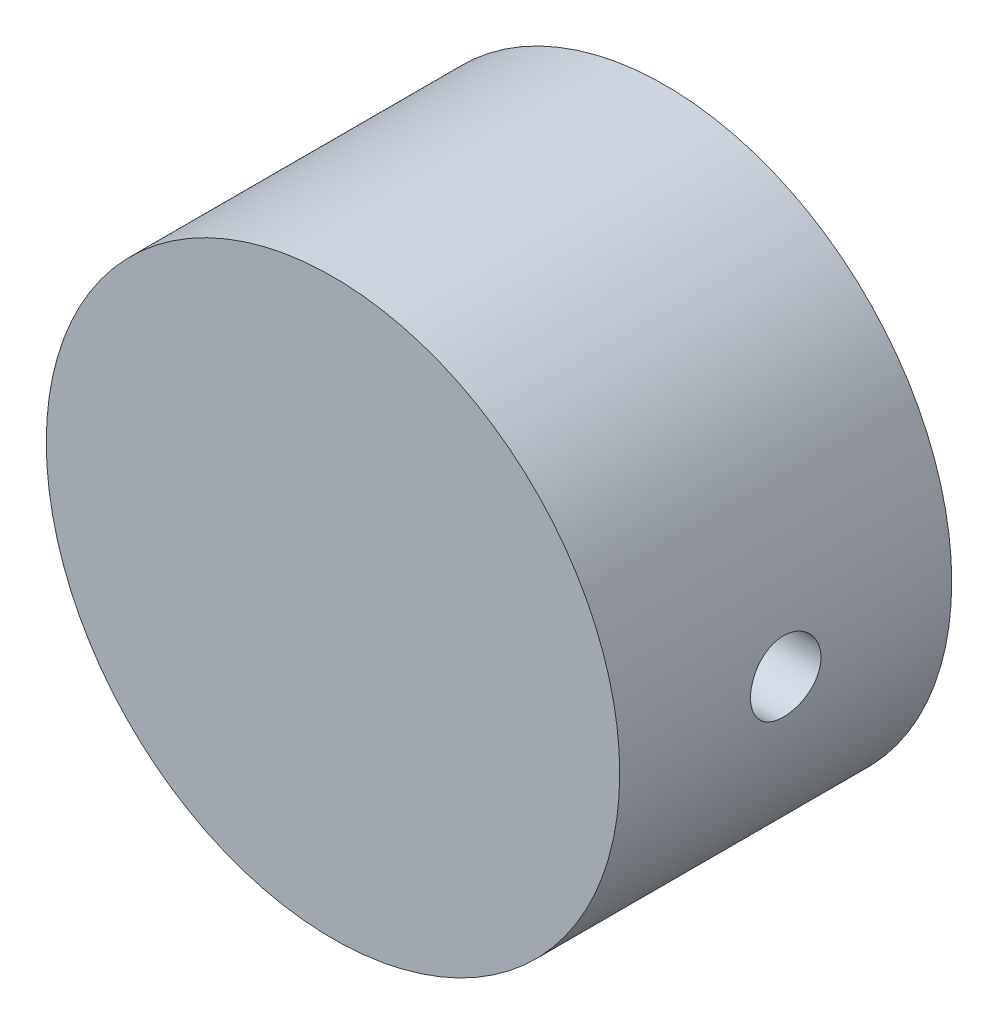
ISO-10303-21;
HEADER;
FILE_DESCRIPTION(('STEP AP214'),'2;1');
FILE_NAME('part.step','',(''),(''),'','','');
FILE_SCHEMA(('AUTOMOTIVE_DESIGN { 1 0 10303 214 1 1 1 1 }'));
ENDSEC;
DATA;
#1=APPLICATION_CONTEXT('core data for automotive mechanical design processes');
#2=APPLICATION_PROTOCOL_DEFINITION('international standard','automotive_design',2000,#1);
#3=PRODUCT_CONTEXT('',#1,'mechanical');
#4=PRODUCT('Part','Part','',(#3));
#5=PRODUCT_RELATED_PRODUCT_CATEGORY('part','',(#4));
#6=PRODUCT_DEFINITION_FORMATION('','',#4);
#7=PRODUCT_DEFINITION_CONTEXT('part definition',#1,'design');
#8=PRODUCT_DEFINITION('design','',#6,#7);
#9=PRODUCT_DEFINITION_SHAPE('','',#8);
#10=(LENGTH_UNIT() NAMED_UNIT(*) SI_UNIT(.MILLI.,.METRE.));
#11=(NAMED_UNIT(*) PLANE_ANGLE_UNIT() SI_UNIT($,.RADIAN.));
#12=(NAMED_UNIT(*) SI_UNIT($,.STERADIAN.) SOLID_ANGLE_UNIT());
#13=UNCERTAINTY_MEASURE_WITH_UNIT(LENGTH_MEASURE(1.E-05),#10,'distance_accuracy_value','');
#14=(GEOMETRIC_REPRESENTATION_CONTEXT(3) GLOBAL_UNCERTAINTY_ASSIGNED_CONTEXT((#13)) GLOBAL_UNIT_ASSIGNED_CONTEXT((#10,
#11,#12)) REPRESENTATION_CONTEXT('',''));
#15=CARTESIAN_POINT('',(0.,0.,0.));
#16=DIRECTION('',(0.,0.,1.));
#17=DIRECTION('',(1.,0.,0.));
#18=AXIS2_PLACEMENT_3D('',#15,#16,#17);
#19=CARTESIAN_POINT('',(0.,0.,33.));
#20=DIRECTION('',(0.,0.,-1.));
#21=DIRECTION('',(-1.,0.,0.));
#22=AXIS2_PLACEMENT_3D('',#19,#20,#21);
#23=CYLINDRICAL_SURFACE('',#22,28.5);
#24=CARTESIAN_POINT('',(28.5,0.,20.));
#25=CARTESIAN_POINT('',(28.4999973075945,0.195805853638055,19.99999166447));
#26=CARTESIAN_POINT('',(28.4979607849814,0.391734749449543,19.9835132072771));
#27=CARTESIAN_POINT('',(28.4900325781088,0.778142451878802,19.9180364344884));
#28=CARTESIAN_POINT('',(28.4841368471188,0.968615318283529,19.8690039822984));
#29=CARTESIAN_POINT('',(28.469154538523,1.33846082848571,19.7398839489643));
#30=CARTESIAN_POINT('',(28.4600700879073,1.51784077807419,19.6598170651926));
#31=CARTESIAN_POINT('',(28.439721237495,1.86058298335746,19.4709457655219));
#32=CARTESIAN_POINT('',(28.4284572174478,2.02394802189263,19.3621463545276));
#33=CARTESIAN_POINT('',(28.4049402198011,2.33092702219105,19.1182791937741));
#34=CARTESIAN_POINT('',(28.3926827994152,2.47444349532867,18.9830891418576));
#35=CARTESIAN_POINT('',(28.3685963976077,2.73681201165952,18.6905407152348));
#36=CARTESIAN_POINT('',(28.356767437844,2.85566280947964,18.5331812218637));
#37=CARTESIAN_POINT('',(28.3348334151536,3.06568780632967,18.200129275887));
#38=CARTESIAN_POINT('',(28.3247340708493,3.15677094301005,18.0243789896551));
#39=CARTESIAN_POINT('',(28.307461073962,3.30809356662311,17.6599322576392));
#40=CARTESIAN_POINT('',(28.3002873142109,3.36833418337814,17.4712362863685));
#41=CARTESIAN_POINT('',(28.2897199741068,3.45596614354758,17.0872649307282));
#42=CARTESIAN_POINT('',(28.2863074848892,3.48352185609143,16.8920275889788));
#43=CARTESIAN_POINT('',(28.2835911244764,3.50551036656904,16.4996720291378));
#44=CARTESIAN_POINT('',(28.2842870936091,3.49994445174911,16.3025538844395));
#45=CARTESIAN_POINT('',(28.2896917118334,3.45598268233477,15.9131764916246));
#46=CARTESIAN_POINT('',(28.2943782490684,3.41776773310538,15.7208964683094));
#47=CARTESIAN_POINT('',(28.3072014569075,3.30987485897261,15.3454993443377));
#48=CARTESIAN_POINT('',(28.3153381951895,3.24019631688838,15.1623824235003));
#49=CARTESIAN_POINT('',(28.3341701086988,3.07115922563233,14.8099466077587));
#50=CARTESIAN_POINT('',(28.3448720589487,2.97172190424309,14.6406658707679));
#51=CARTESIAN_POINT('',(28.3676232741258,2.74604628998771,14.3211257545493));
#52=CARTESIAN_POINT('',(28.3796725985337,2.61980681370139,14.1708672156938));
#53=CARTESIAN_POINT('',(28.4038592258302,2.34310702751868,13.8925866355885));
#54=CARTESIAN_POINT('',(28.415996579398,2.19249075731688,13.7647196220004));
#55=CARTESIAN_POINT('',(28.4389164197614,1.87185025619268,13.5360583147784));
#56=CARTESIAN_POINT('',(28.4496989036149,1.70182598312764,13.435264079932));
#57=CARTESIAN_POINT('',(28.4687004747419,1.34707745666818,13.2636100034387));
#58=CARTESIAN_POINT('',(28.4769187457567,1.1623485458276,13.1927596912159));
#59=CARTESIAN_POINT('',(28.4898584363518,0.783492529884441,13.0831267978119));
#60=CARTESIAN_POINT('',(28.4945800139136,0.589365849797456,13.0443427678594));
#61=CARTESIAN_POINT('',(28.4999738126752,0.198565484651934,13.0001438926792));
#62=CARTESIAN_POINT('',(28.5006719528866,0.00191630024840418,12.9945154536842));
#63=CARTESIAN_POINT('',(28.4980101495548,-0.389522524305116,13.0162241122552));
#64=CARTESIAN_POINT('',(28.4946502893609,-0.584312202565586,13.0435605327399));
#65=CARTESIAN_POINT('',(28.4842661954835,-0.965873730614765,13.1302455101776));
#66=CARTESIAN_POINT('',(28.4772536018295,-1.15266902146619,13.189492399512));
#67=CARTESIAN_POINT('',(28.4603492999475,-1.51367225628343,13.338210930002));
#68=CARTESIAN_POINT('',(28.4504574970675,-1.68787978620076,13.4276835648224));
#69=CARTESIAN_POINT('',(28.4288333197213,-2.01971744766144,13.6348318078718));
#70=CARTESIAN_POINT('',(28.4170920154041,-2.17726060741267,13.7526457910172));
#71=CARTESIAN_POINT('',(28.3931106751512,-2.47041303438414,14.012936407588));
#72=CARTESIAN_POINT('',(28.3808706201457,-2.6060214619392,14.1554139847078));
#73=CARTESIAN_POINT('',(28.3571915284072,-2.85221127103233,14.4619273974024));
#74=CARTESIAN_POINT('',(28.3457572570372,-2.96265119925705,14.6260772690811));
#75=CARTESIAN_POINT('',(28.3250622112112,-3.15439227276744,14.970721420174));
#76=CARTESIAN_POINT('',(28.3158013944689,-3.2356939849775,15.1512153815055));
#77=CARTESIAN_POINT('',(28.3005340274458,-3.36662100790962,15.5229649791196));
#78=CARTESIAN_POINT('',(28.2945192461772,-3.41632649486882,15.7141920255971));
#79=CARTESIAN_POINT('',(28.2864011823517,-3.48290850176682,16.1023568932253));
#80=CARTESIAN_POINT('',(28.2842977246616,-3.49978649158932,16.2992944582812));
#81=CARTESIAN_POINT('',(28.2842454435801,-3.50020807025362,16.6918829011292));
#82=CARTESIAN_POINT('',(28.2862689233618,-3.4839738824905,16.8875335738564));
#83=CARTESIAN_POINT('',(28.29418302305,-3.41910206986612,17.2733033638753));
#84=CARTESIAN_POINT('',(28.3000736438108,-3.37046443784779,17.4634224799453));
#85=CARTESIAN_POINT('',(28.3150498200506,-3.2422351011135,17.8327057416408));
#86=CARTESIAN_POINT('',(28.3241343111609,-3.16265370758292,18.0118735135204));
#87=CARTESIAN_POINT('',(28.3444764337,-2.97481778344512,18.3543474680672));
#88=CARTESIAN_POINT('',(28.3557340886087,-2.86656294303196,18.5176534793278));
#89=CARTESIAN_POINT('',(28.379244622338,-2.62362746765994,18.8249046198102));
#90=CARTESIAN_POINT('',(28.3915034423288,-2.48878117493733,18.9687183217623));
#91=CARTESIAN_POINT('',(28.415582386299,-2.19683507459678,19.2317624600481));
#92=CARTESIAN_POINT('',(28.4274024060174,-2.03973002036515,19.3509870841721));
#93=CARTESIAN_POINT('',(28.4493197116344,-1.70706612661907,19.5618395875749));
#94=CARTESIAN_POINT('',(28.4594105077775,-1.53144160011744,19.6533644532155));
#95=CARTESIAN_POINT('',(28.4766662931322,-1.16729121877161,19.8054931321925));
#96=CARTESIAN_POINT('',(28.4838344713724,-0.978779689422525,19.8661306665061));
#97=CARTESIAN_POINT('',(28.4927023153693,-0.657736477249303,19.9401900811756));
#98=CARTESIAN_POINT('',(28.4954256701138,-0.527232145063983,19.9625867208961));
#99=CARTESIAN_POINT('',(28.4990754155659,-0.264503918981174,19.992494443612));
#100=CARTESIAN_POINT('',(28.5000018189012,-0.132280037174008,20.0000056312117));
#101=CARTESIAN_POINT('',(28.5,0.,20.));
#102=B_SPLINE_CURVE_WITH_KNOTS('',3,(#24,#25,#26,#27,#28,#29,#30,#31,#32,#33,#34,#35,#36,#37,
#38,#39,#40,#41,#42,#43,#44,#45,#46,#47,#48,#49,#50,#51,#52,#53,#54,#55,#56,#57,#58,#59,#60,#61,
#62,#63,#64,#65,#66,#67,#68,#69,#70,#71,#72,#73,#74,#75,#76,#77,#78,#79,#80,#81,#82,#83,#84,#85,
#86,#87,#88,#89,#90,#91,#92,#93,#94,#95,#96,#97,#98,#99,#100,#101),.UNSPECIFIED.,.T.,.F.,(4,2,2,
2,2,2,2,2,2,2,2,2,2,2,2,2,2,2,2,2,2,2,2,2,2,2,2,2,2,2,2,2,2,2,2,2,2,2,4),(0.,0.586934397395153,
1.17448523689835,1.76164490144079,2.34870235631537,2.93854792314202,3.52842326410567,
4.1202127564517,4.71198056882954,5.30075964933592,5.88951584755003,6.47503080199455,
7.06055724223215,7.64764750416009,8.23476369381735,8.82579656329493,9.41683071616878,
10.0080528197646,10.599248210181,11.1866308213129,11.7740013681119,12.3595115116229,
12.9450409055264,13.5334893030094,14.1219602210661,14.7136611249415,15.3053505158305,
15.8955324221796,16.4856879019412,17.0718957469575,17.6581037214518,18.2441165249039,
18.8301356602646,19.419927948008,20.0098594877194,20.6019587232955,21.1934101466813,
21.5899266351567,21.9864403371916),.UNSPECIFIED.);
#103=CARTESIAN_POINT('',(28.5,0.,20.));
#104=VERTEX_POINT('',#103);
#105=EDGE_CURVE('E10',#104,#104,#102,.T.);
#106=ORIENTED_EDGE('',*,*,#105,.T.);
#107=EDGE_LOOP('',(#106));
#108=FACE_BOUND('',#107,.T.);
#109=CARTESIAN_POINT('',(-28.5,0.,20.));
#110=CARTESIAN_POINT('',(-28.4999973075945,-0.195805853638058,19.99999166447));
#111=CARTESIAN_POINT('',(-28.4979607849814,-0.391734749449547,19.9835132072771));
#112=CARTESIAN_POINT('',(-28.4900325781088,-0.778142451878805,19.9180364344884));
#113=CARTESIAN_POINT('',(-28.4841368471188,-0.968615318283532,19.8690039822984));
#114=CARTESIAN_POINT('',(-28.469154538523,-1.33846082848572,19.7398839489643));
#115=CARTESIAN_POINT('',(-28.4600700879073,-1.5178407780742,19.6598170651926));
#116=CARTESIAN_POINT('',(-28.439721237495,-1.86058298335747,19.4709457655219));
#117=CARTESIAN_POINT('',(-28.4284572174478,-2.02394802189263,19.3621463545276));
#118=CARTESIAN_POINT('',(-28.4049402198011,-2.33092702219105,19.1182791937741));
#119=CARTESIAN_POINT('',(-28.3926827994152,-2.47444349532867,18.9830891418576));
#120=CARTESIAN_POINT('',(-28.3685963976077,-2.73681201165953,18.6905407152348));
#121=CARTESIAN_POINT('',(-28.356767437844,-2.85566280947964,18.5331812218637));
#122=CARTESIAN_POINT('',(-28.3348334151536,-3.06568780632967,18.200129275887));
#123=CARTESIAN_POINT('',(-28.3247340708493,-3.15677094301006,18.0243789896551));
#124=CARTESIAN_POINT('',(-28.307461073962,-3.30809356662311,17.6599322576392));
#125=CARTESIAN_POINT('',(-28.3002873142109,-3.36833418337815,17.4712362863685));
#126=CARTESIAN_POINT('',(-28.2897199741068,-3.45596614354759,17.0872649307282));
#127=CARTESIAN_POINT('',(-28.2863074848892,-3.48352185609144,16.8920275889788));
#128=CARTESIAN_POINT('',(-28.2835911244764,-3.50551036656904,16.4996720291378));
#129=CARTESIAN_POINT('',(-28.2842870936091,-3.49994445174912,16.3025538844395));
#130=CARTESIAN_POINT('',(-28.2896917118334,-3.45598268233478,15.9131764916246));
#131=CARTESIAN_POINT('',(-28.2943782490684,-3.41776773310539,15.7208964683094));
#132=CARTESIAN_POINT('',(-28.3072014569075,-3.30987485897262,15.3454993443377));
#133=CARTESIAN_POINT('',(-28.3153381951895,-3.24019631688839,15.1623824235003));
#134=CARTESIAN_POINT('',(-28.3341701086988,-3.07115922563234,14.8099466077587));
#135=CARTESIAN_POINT('',(-28.3448720589487,-2.9717219042431,14.6406658707679));
#136=CARTESIAN_POINT('',(-28.3676232741258,-2.74604628998772,14.3211257545493));
#137=CARTESIAN_POINT('',(-28.3796725985337,-2.6198068137014,14.1708672156938));
#138=CARTESIAN_POINT('',(-28.4038592258302,-2.34310702751869,13.8925866355885));
#139=CARTESIAN_POINT('',(-28.415996579398,-2.19249075731689,13.7647196220004));
#140=CARTESIAN_POINT('',(-28.4389164197614,-1.87185025619269,13.5360583147784));
#141=CARTESIAN_POINT('',(-28.4496989036149,-1.70182598312765,13.435264079932));
#142=CARTESIAN_POINT('',(-28.4687004747419,-1.34707745666819,13.2636100034387));
#143=CARTESIAN_POINT('',(-28.4769187457566,-1.16234854582761,13.1927596912159));
#144=CARTESIAN_POINT('',(-28.4898584363518,-0.783492529884451,13.0831267978119));
#145=CARTESIAN_POINT('',(-28.4945800139136,-0.589365849797465,13.0443427678594));
#146=CARTESIAN_POINT('',(-28.4999738126752,-0.198565484651944,13.0001438926792));
#147=CARTESIAN_POINT('',(-28.5006719528866,-0.00191630024841408,12.9945154536842));
#148=CARTESIAN_POINT('',(-28.4980101495548,0.389522524305106,13.0162241122552));
#149=CARTESIAN_POINT('',(-28.4946502893609,0.584312202565576,13.0435605327399));
#150=CARTESIAN_POINT('',(-28.4842661954835,0.965873730614755,13.1302455101776));
#151=CARTESIAN_POINT('',(-28.4772536018295,1.15266902146618,13.189492399512));
#152=CARTESIAN_POINT('',(-28.4603492999475,1.51367225628343,13.338210930002));
#153=CARTESIAN_POINT('',(-28.4504574970675,1.68787978620076,13.4276835648224));
#154=CARTESIAN_POINT('',(-28.4288333197213,2.01971744766143,13.6348318078718));
#155=CARTESIAN_POINT('',(-28.4170920154041,2.17726060741266,13.7526457910172));
#156=CARTESIAN_POINT('',(-28.3931106751512,2.47041303438413,14.012936407588));
#157=CARTESIAN_POINT('',(-28.3808706201457,2.60602146193919,14.1554139847078));
#158=CARTESIAN_POINT('',(-28.3571915284072,2.85221127103232,14.4619273974024));
#159=CARTESIAN_POINT('',(-28.3457572570372,2.96265119925704,14.6260772690811));
#160=CARTESIAN_POINT('',(-28.3250622112112,3.15439227276743,14.970721420174));
#161=CARTESIAN_POINT('',(-28.3158013944689,3.23569398497749,15.1512153815055));
#162=CARTESIAN_POINT('',(-28.3005340274458,3.36662100790962,15.5229649791196));
#163=CARTESIAN_POINT('',(-28.2945192461772,3.41632649486881,15.7141920255971));
#164=CARTESIAN_POINT('',(-28.2864011823517,3.48290850176681,16.1023568932253));
#165=CARTESIAN_POINT('',(-28.2842977246616,3.49978649158931,16.2992944582812));
#166=CARTESIAN_POINT('',(-28.2842454435801,3.50020807025361,16.6918829011292));
#167=CARTESIAN_POINT('',(-28.2862689233618,3.48397388249049,16.8875335738564));
#168=CARTESIAN_POINT('',(-28.29418302305,3.41910206986611,17.2733033638753));
#169=CARTESIAN_POINT('',(-28.3000736438108,3.37046443784778,17.4634224799453));
#170=CARTESIAN_POINT('',(-28.3150498200506,3.24223510111349,17.8327057416408));
#171=CARTESIAN_POINT('',(-28.3241343111609,3.16265370758292,18.0118735135204));
#172=CARTESIAN_POINT('',(-28.3444764337,2.97481778344511,18.3543474680672));
#173=CARTESIAN_POINT('',(-28.3557340886087,2.86656294303195,18.5176534793278));
#174=CARTESIAN_POINT('',(-28.3792446223381,2.62362746765994,18.8249046198102));
#175=CARTESIAN_POINT('',(-28.3915034423288,2.48878117493732,18.9687183217623));
#176=CARTESIAN_POINT('',(-28.415582386299,2.19683507459677,19.2317624600481));
#177=CARTESIAN_POINT('',(-28.4274024060174,2.03973002036515,19.3509870841721));
#178=CARTESIAN_POINT('',(-28.4493197116344,1.70706612661907,19.5618395875749));
#179=CARTESIAN_POINT('',(-28.4594105077775,1.53144160011743,19.6533644532155));
#180=CARTESIAN_POINT('',(-28.4766662931322,1.1672912187716,19.8054931321925));
#181=CARTESIAN_POINT('',(-28.4838344713724,0.978779689422519,19.8661306665061));
#182=CARTESIAN_POINT('',(-28.4927023153693,0.657736477249299,19.9401900811756));
#183=CARTESIAN_POINT('',(-28.4954256701138,0.527232145063979,19.9625867208961));
#184=CARTESIAN_POINT('',(-28.4990754155659,0.264503918981171,19.992494443612));
#185=CARTESIAN_POINT('',(-28.5000018189012,0.132280037174004,20.0000056312117));
#186=CARTESIAN_POINT('',(-28.5,0.,20.));
#187=B_SPLINE_CURVE_WITH_KNOTS('',3,(#109,#110,#111,#112,#113,#114,#115,#116,#117,#118,#119,
#120,#121,#122,#123,#124,#125,#126,#127,#128,#129,#130,#131,#132,#133,#134,#135,#136,#137,#138,
#139,#140,#141,#142,#143,#144,#145,#146,#147,#148,#149,#150,#151,#152,#153,#154,#155,#156,#157,
#158,#159,#160,#161,#162,#163,#164,#165,#166,#167,#168,#169,#170,#171,#172,#173,#174,#175,#176,
#177,#178,#179,#180,#181,#182,#183,#184,#185,#186),.UNSPECIFIED.,.T.,.F.,(4,2,2,2,2,2,2,2,2,2,2,
2,2,2,2,2,2,2,2,2,2,2,2,2,2,2,2,2,2,2,2,2,2,2,2,2,2,2,4),(0.,0.586934397395152,1.17448523689835,
1.76164490144079,2.34870235631537,2.93854792314202,3.52842326410567,4.12021275645171,
4.71198056882955,5.30075964933592,5.88951584755003,6.47503080199455,7.06055724223215,
7.6476475041601,8.23476369381735,8.82579656329493,9.41683071616878,10.0080528197646,
10.599248210181,11.1866308213129,11.7740013681119,12.3595115116229,12.9450409055264,
13.5334893030094,14.1219602210661,14.7136611249415,15.3053505158305,15.8955324221796,
16.4856879019412,17.0718957469575,17.6581037214518,18.2441165249039,18.8301356602646,
19.419927948008,20.0098594877194,20.6019587232955,21.1934101466813,21.5899266351567,
21.9864403371916),.UNSPECIFIED.);
#188=CARTESIAN_POINT('',(-28.5,0.,20.));
#189=VERTEX_POINT('',#188);
#190=EDGE_CURVE('E49',#189,#189,#187,.T.);
#191=ORIENTED_EDGE('',*,*,#190,.T.);
#192=EDGE_LOOP('',(#191));
#193=FACE_BOUND('',#192,.T.);
#194=CARTESIAN_POINT('',(0.,0.,33.));
#195=DIRECTION('',(0.,0.,1.));
#196=DIRECTION('',(1.,0.,0.));
#197=AXIS2_PLACEMENT_3D('',#194,#195,#196);
#198=CIRCLE('',#197,28.5);
#199=CARTESIAN_POINT('',(28.5,0.,33.));
#200=VERTEX_POINT('',#199);
#201=EDGE_CURVE('E54',#200,#200,#198,.T.);
#202=ORIENTED_EDGE('',*,*,#201,.F.);
#203=EDGE_LOOP('',(#202));
#204=FACE_BOUND('',#203,.T.);
#205=CARTESIAN_POINT('',(0.,0.,0.));
#206=DIRECTION('',(0.,0.,1.));
#207=DIRECTION('',(1.,0.,0.));
#208=AXIS2_PLACEMENT_3D('',#205,#206,#207);
#209=CIRCLE('',#208,28.5);
#210=CARTESIAN_POINT('',(28.5,0.,0.));
#211=VERTEX_POINT('',#210);
#212=EDGE_CURVE('E59',#211,#211,#209,.T.);
#213=ORIENTED_EDGE('',*,*,#212,.T.);
#214=EDGE_LOOP('',(#213));
#215=FACE_BOUND('',#214,.T.);
#216=ADVANCED_FACE('F37',(#108,#193,#204,#215),#23,.T.);
#217=CARTESIAN_POINT('',(0.,0.,33.));
#218=DIRECTION('',(0.,0.,1.));
#219=DIRECTION('',(1.,0.,0.));
#220=AXIS2_PLACEMENT_3D('',#217,#218,#219);
#221=PLANE('',#220);
#222=ORIENTED_EDGE('',*,*,#201,.T.);
#223=EDGE_LOOP('',(#222));
#224=FACE_BOUND('',#223,.T.);
#225=ADVANCED_FACE('F71',(#224),#221,.T.);
#226=CARTESIAN_POINT('',(0.,0.,0.));
#227=DIRECTION('',(0.,0.,1.));
#228=DIRECTION('',(1.,0.,0.));
#229=AXIS2_PLACEMENT_3D('',#226,#227,#228);
#230=PLANE('',#229);
#231=ORIENTED_EDGE('',*,*,#212,.F.);
#232=EDGE_LOOP('',(#231));
#233=FACE_BOUND('',#232,.T.);
#234=ADVANCED_FACE('F69',(#233),#230,.F.);
#235=CARTESIAN_POINT('',(28.5,0.,16.5));
#236=DIRECTION('',(-1.,0.,0.));
#237=DIRECTION('',(0.,0.,1.));
#238=AXIS2_PLACEMENT_3D('',#235,#236,#237);
#239=CYLINDRICAL_SURFACE('',#238,3.5);
#240=ORIENTED_EDGE('',*,*,#190,.F.);
#241=EDGE_LOOP('',(#240));
#242=FACE_BOUND('',#241,.T.);
#243=ORIENTED_EDGE('',*,*,#105,.F.);
#244=EDGE_LOOP('',(#243));
#245=FACE_BOUND('',#244,.T.);
#246=ADVANCED_FACE('F65',(#242,#245),#239,.F.);
#247=CLOSED_SHELL('',(#216,#225,#234,#246));
#248=MANIFOLD_SOLID_BREP('B2',#247);
#249=ADVANCED_BREP_SHAPE_REPRESENTATION('',(#18,#248),#14);
#250=SHAPE_DEFINITION_REPRESENTATION(#9,#249);
ENDSEC;
END-ISO-10303-21;
